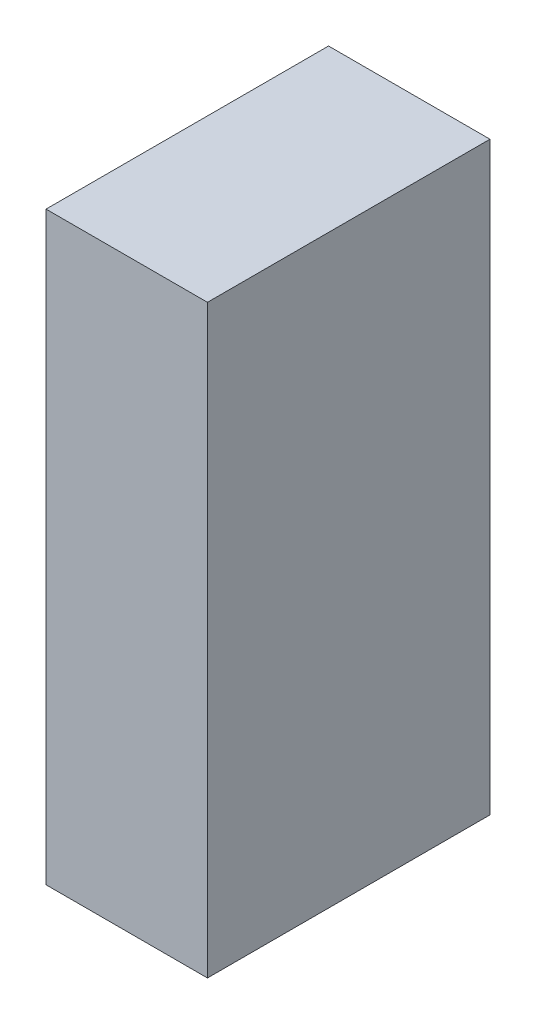
ISO-10303-21;
HEADER;
FILE_DESCRIPTION(('STEP AP214'),'2;1');
FILE_NAME('part.step','',(''),(''),'','','');
FILE_SCHEMA(('AUTOMOTIVE_DESIGN { 1 0 10303 214 1 1 1 1 }'));
ENDSEC;
DATA;
#1=APPLICATION_CONTEXT('core data for automotive mechanical design processes');
#2=APPLICATION_PROTOCOL_DEFINITION('international standard','automotive_design',2000,#1);
#3=PRODUCT_CONTEXT('',#1,'mechanical');
#4=PRODUCT('Part','Part','',(#3));
#5=PRODUCT_RELATED_PRODUCT_CATEGORY('part','',(#4));
#6=PRODUCT_DEFINITION_FORMATION('','',#4);
#7=PRODUCT_DEFINITION_CONTEXT('part definition',#1,'design');
#8=PRODUCT_DEFINITION('design','',#6,#7);
#9=PRODUCT_DEFINITION_SHAPE('','',#8);
#10=(LENGTH_UNIT() NAMED_UNIT(*) SI_UNIT(.MILLI.,.METRE.));
#11=(NAMED_UNIT(*) PLANE_ANGLE_UNIT() SI_UNIT($,.RADIAN.));
#12=(NAMED_UNIT(*) SI_UNIT($,.STERADIAN.) SOLID_ANGLE_UNIT());
#13=UNCERTAINTY_MEASURE_WITH_UNIT(LENGTH_MEASURE(1.E-05),#10,'distance_accuracy_value','');
#14=(GEOMETRIC_REPRESENTATION_CONTEXT(3) GLOBAL_UNCERTAINTY_ASSIGNED_CONTEXT((#13)) GLOBAL_UNIT_ASSIGNED_CONTEXT((#10,
#11,#12)) REPRESENTATION_CONTEXT('',''));
#15=CARTESIAN_POINT('',(0.,0.,0.));
#16=DIRECTION('',(0.,0.,1.));
#17=DIRECTION('',(1.,0.,0.));
#18=AXIS2_PLACEMENT_3D('',#15,#16,#17);
#19=CARTESIAN_POINT('',(0.700014455790608,0.724970512137929,0.));
#20=DIRECTION('',(-1.,4.37113882867379E-08,0.));
#21=DIRECTION('',(-4.37113882867379E-08,-1.,0.));
#22=AXIS2_PLACEMENT_3D('',#19,#20,#21);
#23=PLANE('',#22);
#24=DIRECTION('',(-4.37113883156005E-08,-0.999999999999999,0.));
#25=VECTOR('',#24,1.);
#26=CARTESIAN_POINT('',(0.700014455790608,0.724970512137929,0.));
#27=LINE('',#26,#25);
#28=CARTESIAN_POINT('',(0.700014455790608,0.724970512137929,0.));
#29=VERTEX_POINT('',#28);
#30=CARTESIAN_POINT('',(0.700014392409898,-0.725011177315196,0.));
#31=VERTEX_POINT('',#30);
#32=EDGE_CURVE('E11',#29,#31,#27,.T.);
#33=ORIENTED_EDGE('',*,*,#32,.T.);
#34=DIRECTION('',(0.,0.,1.));
#35=VECTOR('',#34,1.);
#36=CARTESIAN_POINT('',(0.700014392409896,-0.725011177315196,0.));
#37=LINE('',#36,#35);
#38=CARTESIAN_POINT('',(0.700014392409898,-0.725011177315196,0.700001120567322));
#39=VERTEX_POINT('',#38);
#40=EDGE_CURVE('E88',#31,#39,#37,.T.);
#41=ORIENTED_EDGE('',*,*,#40,.T.);
#42=DIRECTION('',(-4.37113883156005E-08,-0.999999999999999,0.));
#43=VECTOR('',#42,1.);
#44=CARTESIAN_POINT('',(0.700014455790608,0.724970512137929,0.700001120567322));
#45=LINE('',#44,#43);
#46=CARTESIAN_POINT('',(0.700014455790608,0.724970512137929,0.700001120567322));
#47=VERTEX_POINT('',#46);
#48=EDGE_CURVE('E83',#47,#39,#45,.T.);
#49=ORIENTED_EDGE('',*,*,#48,.F.);
#50=DIRECTION('',(0.,0.,1.));
#51=VECTOR('',#50,1.);
#52=CARTESIAN_POINT('',(0.700014455790608,0.724970512137921,0.));
#53=LINE('',#52,#51);
#54=EDGE_CURVE('E72',#29,#47,#53,.T.);
#55=ORIENTED_EDGE('',*,*,#54,.F.);
#56=EDGE_LOOP('',(#33,#41,#49,#55));
#57=FACE_BOUND('',#56,.T.);
#58=ADVANCED_FACE('F17',(#57),#23,.T.);
#59=CARTESIAN_POINT('',(0.700014392409898,-0.725011177315196,0.));
#60=DIRECTION('',(-4.37113882867379E-08,-1.,0.));
#61=DIRECTION('',(1.,-4.37113882867379E-08,0.));
#62=AXIS2_PLACEMENT_3D('',#59,#60,#61);
#63=PLANE('',#62);
#64=DIRECTION('',(0.999999999999999,-4.37113884141336E-08,0.));
#65=VECTOR('',#64,1.);
#66=CARTESIAN_POINT('',(0.700014392409898,-0.725011177315196,0.));
#67=LINE('',#66,#65);
#68=CARTESIAN_POINT('',(1.10000828889427,-0.725011194799492,0.));
#69=VERTEX_POINT('',#68);
#70=EDGE_CURVE('E24',#31,#69,#67,.T.);
#71=ORIENTED_EDGE('',*,*,#70,.T.);
#72=DIRECTION('',(0.,0.,1.));
#73=VECTOR('',#72,1.);
#74=CARTESIAN_POINT('',(1.10000828889427,-0.725011194799484,0.));
#75=LINE('',#74,#73);
#76=CARTESIAN_POINT('',(1.10000828889427,-0.725011194799492,0.700001120567322));
#77=VERTEX_POINT('',#76);
#78=EDGE_CURVE('E85',#69,#77,#75,.T.);
#79=ORIENTED_EDGE('',*,*,#78,.T.);
#80=DIRECTION('',(0.999999999999999,-4.37113884141336E-08,0.));
#81=VECTOR('',#80,1.);
#82=CARTESIAN_POINT('',(0.700014392409898,-0.725011177315196,0.700001120567322));
#83=LINE('',#82,#81);
#84=EDGE_CURVE('E66',#39,#77,#83,.T.);
#85=ORIENTED_EDGE('',*,*,#84,.F.);
#86=ORIENTED_EDGE('',*,*,#40,.F.);
#87=EDGE_LOOP('',(#71,#79,#85,#86));
#88=FACE_BOUND('',#87,.T.);
#89=ADVANCED_FACE('F89',(#88),#63,.T.);
#90=CARTESIAN_POINT('',(1.10000828889427,-0.725011194799492,0.));
#91=DIRECTION('',(1.,-4.37113882867379E-08,0.));
#92=DIRECTION('',(4.37113882867379E-08,1.,0.));
#93=AXIS2_PLACEMENT_3D('',#90,#91,#92);
#94=PLANE('',#93);
#95=DIRECTION('',(4.37113883156005E-08,0.999999999999999,0.));
#96=VECTOR('',#95,1.);
#97=CARTESIAN_POINT('',(1.10000828889427,-0.725011194799492,0.));
#98=LINE('',#97,#96);
#99=CARTESIAN_POINT('',(1.10000835227498,0.724970494653633,0.));
#100=VERTEX_POINT('',#99);
#101=EDGE_CURVE('E62',#69,#100,#98,.T.);
#102=ORIENTED_EDGE('',*,*,#101,.T.);
#103=DIRECTION('',(0.,0.,1.));
#104=VECTOR('',#103,1.);
#105=CARTESIAN_POINT('',(1.10000835227499,0.724970494653633,0.));
#106=LINE('',#105,#104);
#107=CARTESIAN_POINT('',(1.10000835227498,0.724970494653633,0.700001120567322));
#108=VERTEX_POINT('',#107);
#109=EDGE_CURVE('E55',#100,#108,#106,.T.);
#110=ORIENTED_EDGE('',*,*,#109,.T.);
#111=DIRECTION('',(4.37113883156005E-08,0.999999999999999,0.));
#112=VECTOR('',#111,1.);
#113=CARTESIAN_POINT('',(1.10000828889427,-0.725011194799492,0.700001120567322));
#114=LINE('',#113,#112);
#115=EDGE_CURVE('E59',#77,#108,#114,.T.);
#116=ORIENTED_EDGE('',*,*,#115,.F.);
#117=ORIENTED_EDGE('',*,*,#78,.F.);
#118=EDGE_LOOP('',(#102,#110,#116,#117));
#119=FACE_BOUND('',#118,.T.);
#120=ADVANCED_FACE('F57',(#119),#94,.T.);
#121=CARTESIAN_POINT('',(1.10000835227498,0.724970494653633,0.));
#122=DIRECTION('',(4.37113882867379E-08,1.,0.));
#123=DIRECTION('',(-1.,4.37113882867379E-08,0.));
#124=AXIS2_PLACEMENT_3D('',#121,#122,#123);
#125=PLANE('',#124);
#126=DIRECTION('',(-0.999999999999999,4.37113884141336E-08,0.));
#127=VECTOR('',#126,1.);
#128=CARTESIAN_POINT('',(1.10000835227498,0.724970494653633,0.));
#129=LINE('',#128,#127);
#130=EDGE_CURVE('E65',#100,#29,#129,.T.);
#131=ORIENTED_EDGE('',*,*,#130,.T.);
#132=ORIENTED_EDGE('',*,*,#54,.T.);
#133=DIRECTION('',(-0.999999999999999,4.37113884141336E-08,0.));
#134=VECTOR('',#133,1.);
#135=CARTESIAN_POINT('',(1.10000835227498,0.724970494653633,0.700001120567322));
#136=LINE('',#135,#134);
#137=EDGE_CURVE('E70',#108,#47,#136,.T.);
#138=ORIENTED_EDGE('',*,*,#137,.F.);
#139=ORIENTED_EDGE('',*,*,#109,.F.);
#140=EDGE_LOOP('',(#131,#132,#138,#139));
#141=FACE_BOUND('',#140,.T.);
#142=ADVANCED_FACE('F71',(#141),#125,.T.);
#143=CARTESIAN_POINT('',(-115.374969482422,472.899963378906,0.700001120567322));
#144=DIRECTION('',(0.,0.,1.));
#145=DIRECTION('',(-4.37113882867379E-08,-1.,0.));
#146=AXIS2_PLACEMENT_3D('',#143,#144,#145);
#147=PLANE('',#146);
#148=ORIENTED_EDGE('',*,*,#48,.T.);
#149=ORIENTED_EDGE('',*,*,#84,.T.);
#150=ORIENTED_EDGE('',*,*,#115,.T.);
#151=ORIENTED_EDGE('',*,*,#137,.T.);
#152=EDGE_LOOP('',(#148,#149,#150,#151));
#153=FACE_BOUND('',#152,.T.);
#154=ADVANCED_FACE('F76',(#153),#147,.T.);
#155=CARTESIAN_POINT('',(-115.374969482422,472.899963378906,0.));
#156=DIRECTION('',(0.,0.,1.));
#157=DIRECTION('',(-4.37113882867379E-08,-1.,0.));
#158=AXIS2_PLACEMENT_3D('',#155,#156,#157);
#159=PLANE('',#158);
#160=ORIENTED_EDGE('',*,*,#130,.F.);
#161=ORIENTED_EDGE('',*,*,#101,.F.);
#162=ORIENTED_EDGE('',*,*,#70,.F.);
#163=ORIENTED_EDGE('',*,*,#32,.F.);
#164=EDGE_LOOP('',(#160,#161,#162,#163));
#165=FACE_BOUND('',#164,.T.);
#166=ADVANCED_FACE('F91',(#165),#159,.F.);
#167=CLOSED_SHELL('',(#58,#89,#120,#142,#154,#166));
#168=MANIFOLD_SOLID_BREP('B1',#167);
#169=ADVANCED_BREP_SHAPE_REPRESENTATION('',(#18,#168),#14);
#170=SHAPE_DEFINITION_REPRESENTATION(#9,#169);
ENDSEC;
END-ISO-10303-21;
